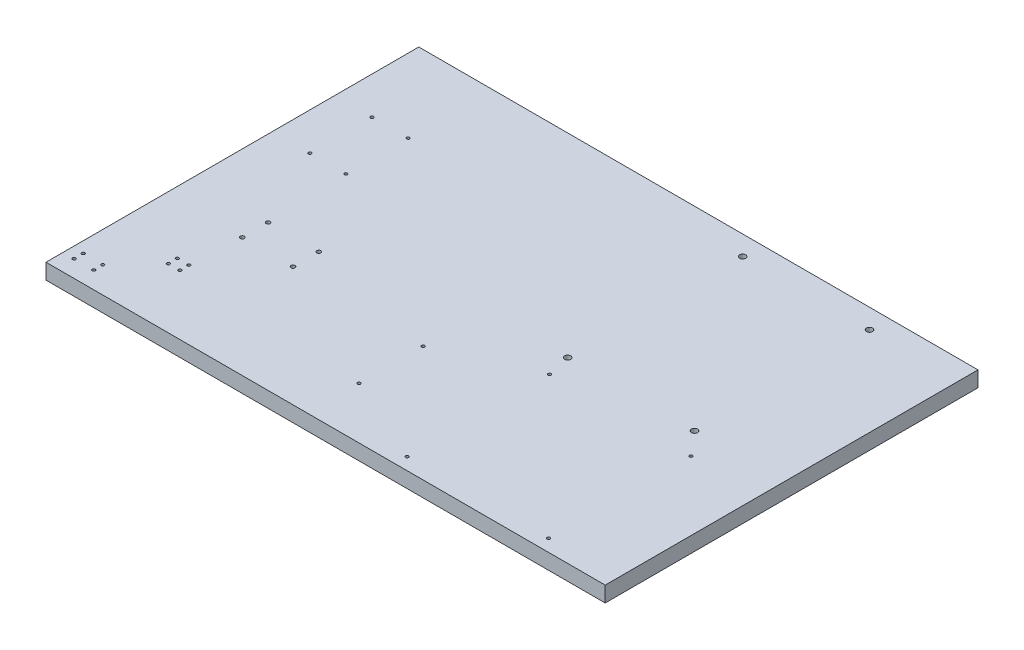
ISO-10303-21;
HEADER;
FILE_DESCRIPTION(('STEP AP214'),'2;1');
FILE_NAME('part.step','',(''),(''),'','','');
FILE_SCHEMA(('AUTOMOTIVE_DESIGN { 1 0 10303 214 1 1 1 1 }'));
ENDSEC;
DATA;
#1=APPLICATION_CONTEXT('core data for automotive mechanical design processes');
#2=APPLICATION_PROTOCOL_DEFINITION('international standard','automotive_design',2000,#1);
#3=PRODUCT_CONTEXT('',#1,'mechanical');
#4=PRODUCT('Part','Part','',(#3));
#5=PRODUCT_RELATED_PRODUCT_CATEGORY('part','',(#4));
#6=PRODUCT_DEFINITION_FORMATION('','',#4);
#7=PRODUCT_DEFINITION_CONTEXT('part definition',#1,'design');
#8=PRODUCT_DEFINITION('design','',#6,#7);
#9=PRODUCT_DEFINITION_SHAPE('','',#8);
#10=(LENGTH_UNIT() NAMED_UNIT(*) SI_UNIT(.MILLI.,.METRE.));
#11=(NAMED_UNIT(*) PLANE_ANGLE_UNIT() SI_UNIT($,.RADIAN.));
#12=(NAMED_UNIT(*) SI_UNIT($,.STERADIAN.) SOLID_ANGLE_UNIT());
#13=UNCERTAINTY_MEASURE_WITH_UNIT(LENGTH_MEASURE(1.E-05),#10,'distance_accuracy_value','');
#14=(GEOMETRIC_REPRESENTATION_CONTEXT(3) GLOBAL_UNCERTAINTY_ASSIGNED_CONTEXT((#13)) GLOBAL_UNIT_ASSIGNED_CONTEXT((#10,
#11,#12)) REPRESENTATION_CONTEXT('',''));
#15=CARTESIAN_POINT('',(0.,0.,0.));
#16=DIRECTION('',(0.,0.,1.));
#17=DIRECTION('',(1.,0.,0.));
#18=AXIS2_PLACEMENT_3D('',#15,#16,#17);
#19=CARTESIAN_POINT('',(0.,12.7,0.));
#20=DIRECTION('',(1.,0.,0.));
#21=DIRECTION('',(0.,0.,-1.));
#22=AXIS2_PLACEMENT_3D('',#19,#20,#21);
#23=PLANE('',#22);
#24=DIRECTION('',(0.,0.,1.));
#25=VECTOR('',#24,1.);
#26=CARTESIAN_POINT('',(0.,0.,0.));
#27=LINE('',#26,#25);
#28=CARTESIAN_POINT('',(0.,0.,-304.8));
#29=VERTEX_POINT('',#28);
#30=CARTESIAN_POINT('',(0.,0.,0.));
#31=VERTEX_POINT('',#30);
#32=EDGE_CURVE('E100',#29,#31,#27,.T.);
#33=ORIENTED_EDGE('',*,*,#32,.T.);
#34=DIRECTION('',(0.,-1.,0.));
#35=VECTOR('',#34,1.);
#36=CARTESIAN_POINT('',(0.,12.7,0.));
#37=LINE('',#36,#35);
#38=CARTESIAN_POINT('',(0.,12.7,0.));
#39=VERTEX_POINT('',#38);
#40=EDGE_CURVE('E11',#39,#31,#37,.T.);
#41=ORIENTED_EDGE('',*,*,#40,.F.);
#42=DIRECTION('',(0.,0.,1.));
#43=VECTOR('',#42,1.);
#44=CARTESIAN_POINT('',(0.,12.7,0.));
#45=LINE('',#44,#43);
#46=CARTESIAN_POINT('',(0.,12.7,-304.8));
#47=VERTEX_POINT('',#46);
#48=EDGE_CURVE('E88',#47,#39,#45,.T.);
#49=ORIENTED_EDGE('',*,*,#48,.F.);
#50=DIRECTION('',(0.,-1.,0.));
#51=VECTOR('',#50,1.);
#52=CARTESIAN_POINT('',(0.,12.7,-304.8));
#53=LINE('',#52,#51);
#54=EDGE_CURVE('E96',#47,#29,#53,.T.);
#55=ORIENTED_EDGE('',*,*,#54,.T.);
#56=EDGE_LOOP('',(#33,#41,#49,#55));
#57=FACE_BOUND('',#56,.T.);
#58=ADVANCED_FACE('F37',(#57),#23,.F.);
#59=CARTESIAN_POINT('',(0.,12.7,0.));
#60=DIRECTION('',(0.,0.,-1.));
#61=DIRECTION('',(-1.,0.,0.));
#62=AXIS2_PLACEMENT_3D('',#59,#60,#61);
#63=PLANE('',#62);
#64=DIRECTION('',(1.,0.,0.));
#65=VECTOR('',#64,1.);
#66=CARTESIAN_POINT('',(0.,0.,0.));
#67=LINE('',#66,#65);
#68=CARTESIAN_POINT('',(457.2,0.,0.));
#69=VERTEX_POINT('',#68);
#70=EDGE_CURVE('E92',#31,#69,#67,.T.);
#71=ORIENTED_EDGE('',*,*,#70,.T.);
#72=DIRECTION('',(0.,-1.,0.));
#73=VECTOR('',#72,1.);
#74=CARTESIAN_POINT('',(457.2,12.7,0.));
#75=LINE('',#74,#73);
#76=CARTESIAN_POINT('',(457.2,12.7,0.));
#77=VERTEX_POINT('',#76);
#78=EDGE_CURVE('E45',#77,#69,#75,.T.);
#79=ORIENTED_EDGE('',*,*,#78,.F.);
#80=DIRECTION('',(1.,0.,0.));
#81=VECTOR('',#80,1.);
#82=CARTESIAN_POINT('',(0.,12.7,0.));
#83=LINE('',#82,#81);
#84=EDGE_CURVE('E83',#39,#77,#83,.T.);
#85=ORIENTED_EDGE('',*,*,#84,.F.);
#86=ORIENTED_EDGE('',*,*,#40,.T.);
#87=EDGE_LOOP('',(#71,#79,#85,#86));
#88=FACE_BOUND('',#87,.T.);
#89=ADVANCED_FACE('F91',(#88),#63,.F.);
#90=CARTESIAN_POINT('',(457.2,12.7,0.));
#91=DIRECTION('',(-1.,0.,0.));
#92=DIRECTION('',(0.,0.,1.));
#93=AXIS2_PLACEMENT_3D('',#90,#91,#92);
#94=PLANE('',#93);
#95=DIRECTION('',(0.,0.,-1.));
#96=VECTOR('',#95,1.);
#97=CARTESIAN_POINT('',(457.2,0.,0.));
#98=LINE('',#97,#96);
#99=CARTESIAN_POINT('',(457.2,0.,-304.8));
#100=VERTEX_POINT('',#99);
#101=EDGE_CURVE('E70',#69,#100,#98,.T.);
#102=ORIENTED_EDGE('',*,*,#101,.T.);
#103=DIRECTION('',(0.,-1.,0.));
#104=VECTOR('',#103,1.);
#105=CARTESIAN_POINT('',(457.2,12.7,-304.8));
#106=LINE('',#105,#104);
#107=CARTESIAN_POINT('',(457.2,12.7,-304.8));
#108=VERTEX_POINT('',#107);
#109=EDGE_CURVE('E93',#108,#100,#106,.T.);
#110=ORIENTED_EDGE('',*,*,#109,.F.);
#111=DIRECTION('',(0.,0.,-1.));
#112=VECTOR('',#111,1.);
#113=CARTESIAN_POINT('',(457.2,12.7,0.));
#114=LINE('',#113,#112);
#115=EDGE_CURVE('E86',#77,#108,#114,.T.);
#116=ORIENTED_EDGE('',*,*,#115,.F.);
#117=ORIENTED_EDGE('',*,*,#78,.T.);
#118=EDGE_LOOP('',(#102,#110,#116,#117));
#119=FACE_BOUND('',#118,.T.);
#120=ADVANCED_FACE('F94',(#119),#94,.F.);
#121=CARTESIAN_POINT('',(0.,12.7,-304.8));
#122=DIRECTION('',(0.,0.,1.));
#123=DIRECTION('',(1.,0.,0.));
#124=AXIS2_PLACEMENT_3D('',#121,#122,#123);
#125=PLANE('',#124);
#126=DIRECTION('',(-1.,0.,0.));
#127=VECTOR('',#126,1.);
#128=CARTESIAN_POINT('',(0.,0.,-304.8));
#129=LINE('',#128,#127);
#130=EDGE_CURVE('E76',#100,#29,#129,.T.);
#131=ORIENTED_EDGE('',*,*,#130,.T.);
#132=ORIENTED_EDGE('',*,*,#54,.F.);
#133=DIRECTION('',(-1.,0.,0.));
#134=VECTOR('',#133,1.);
#135=CARTESIAN_POINT('',(0.,12.7,-304.8));
#136=LINE('',#135,#134);
#137=EDGE_CURVE('E53',#108,#47,#136,.T.);
#138=ORIENTED_EDGE('',*,*,#137,.F.);
#139=ORIENTED_EDGE('',*,*,#109,.T.);
#140=EDGE_LOOP('',(#131,#132,#138,#139));
#141=FACE_BOUND('',#140,.T.);
#142=ADVANCED_FACE('F108',(#141),#125,.F.);
#143=CARTESIAN_POINT('',(0.,12.7,0.));
#144=DIRECTION('',(0.,-1.,0.));
#145=DIRECTION('',(0.,0.,-1.));
#146=AXIS2_PLACEMENT_3D('',#143,#144,#145);
#147=PLANE('',#146);
#148=CARTESIAN_POINT('',(400.9,12.7,-10.));
#149=DIRECTION('',(0.,1.,0.));
#150=DIRECTION('',(0.,0.,1.));
#151=AXIS2_PLACEMENT_3D('',#148,#149,#150);
#152=CIRCLE('',#151,1.24999999999997);
#153=CARTESIAN_POINT('',(400.9,12.7,-8.75000000000003));
#154=VERTEX_POINT('',#153);
#155=EDGE_CURVE('E266',#154,#154,#152,.T.);
#156=ORIENTED_EDGE('',*,*,#155,.F.);
#157=EDGE_LOOP('',(#156));
#158=FACE_BOUND('',#157,.T.);
#159=CARTESIAN_POINT('',(285.3,12.7,-10.));
#160=DIRECTION('',(0.,1.,0.));
#161=DIRECTION('',(0.,0.,1.));
#162=AXIS2_PLACEMENT_3D('',#159,#160,#161);
#163=CIRCLE('',#162,1.24999999999997);
#164=CARTESIAN_POINT('',(285.3,12.7,-8.75000000000003));
#165=VERTEX_POINT('',#164);
#166=EDGE_CURVE('E260',#165,#165,#163,.T.);
#167=ORIENTED_EDGE('',*,*,#166,.F.);
#168=EDGE_LOOP('',(#167));
#169=FACE_BOUND('',#168,.T.);
#170=CARTESIAN_POINT('',(285.3,12.7,-126.425));
#171=DIRECTION('',(0.,1.,0.));
#172=DIRECTION('',(0.,0.,1.));
#173=AXIS2_PLACEMENT_3D('',#170,#171,#172);
#174=CIRCLE('',#173,1.24999999999997);
#175=CARTESIAN_POINT('',(285.3,12.7,-125.175));
#176=VERTEX_POINT('',#175);
#177=EDGE_CURVE('E254',#176,#176,#174,.T.);
#178=ORIENTED_EDGE('',*,*,#177,.F.);
#179=EDGE_LOOP('',(#178));
#180=FACE_BOUND('',#179,.T.);
#181=CARTESIAN_POINT('',(400.9,12.7,-126.425));
#182=DIRECTION('',(0.,1.,0.));
#183=DIRECTION('',(0.,0.,1.));
#184=AXIS2_PLACEMENT_3D('',#181,#182,#183);
#185=CIRCLE('',#184,1.24999999999997);
#186=CARTESIAN_POINT('',(400.9,12.7,-125.175));
#187=VERTEX_POINT('',#186);
#188=EDGE_CURVE('E248',#187,#187,#185,.T.);
#189=ORIENTED_EDGE('',*,*,#188,.F.);
#190=EDGE_LOOP('',(#189));
#191=FACE_BOUND('',#190,.T.);
#192=CARTESIAN_POINT('',(213.72,12.7,-94.6500000000001));
#193=DIRECTION('',(0.,1.,0.));
#194=DIRECTION('',(0.,0.,1.));
#195=AXIS2_PLACEMENT_3D('',#192,#193,#194);
#196=CIRCLE('',#195,1.25);
#197=CARTESIAN_POINT('',(213.72,12.7,-93.4000000000001));
#198=VERTEX_POINT('',#197);
#199=EDGE_CURVE('E242',#198,#198,#196,.T.);
#200=ORIENTED_EDGE('',*,*,#199,.F.);
#201=EDGE_LOOP('',(#200));
#202=FACE_BOUND('',#201,.T.);
#203=CARTESIAN_POINT('',(213.72,12.7,-42.1500000000001));
#204=DIRECTION('',(0.,1.,0.));
#205=DIRECTION('',(0.,0.,1.));
#206=AXIS2_PLACEMENT_3D('',#203,#204,#205);
#207=CIRCLE('',#206,1.25);
#208=CARTESIAN_POINT('',(213.72,12.7,-40.9000000000001));
#209=VERTEX_POINT('',#208);
#210=EDGE_CURVE('E236',#209,#209,#207,.T.);
#211=ORIENTED_EDGE('',*,*,#210,.F.);
#212=EDGE_LOOP('',(#211));
#213=FACE_BOUND('',#212,.T.);
#214=CARTESIAN_POINT('',(384.5,12.7,-288.8));
#215=DIRECTION('',(0.,1.,0.));
#216=DIRECTION('',(0.,0.,1.));
#217=AXIS2_PLACEMENT_3D('',#214,#215,#216);
#218=CIRCLE('',#217,2.5);
#219=CARTESIAN_POINT('',(384.5,12.7,-286.3));
#220=VERTEX_POINT('',#219);
#221=EDGE_CURVE('E230',#220,#220,#218,.T.);
#222=ORIENTED_EDGE('',*,*,#221,.F.);
#223=EDGE_LOOP('',(#222));
#224=FACE_BOUND('',#223,.T.);
#225=CARTESIAN_POINT('',(280.778201797394,12.7,-288.8));
#226=DIRECTION('',(0.,1.,0.));
#227=DIRECTION('',(0.,0.,1.));
#228=AXIS2_PLACEMENT_3D('',#225,#226,#227);
#229=CIRCLE('',#228,2.5);
#230=CARTESIAN_POINT('',(280.778201797394,12.7,-286.3));
#231=VERTEX_POINT('',#230);
#232=EDGE_CURVE('E224',#231,#231,#229,.T.);
#233=ORIENTED_EDGE('',*,*,#232,.F.);
#234=EDGE_LOOP('',(#233));
#235=FACE_BOUND('',#234,.T.);
#236=CARTESIAN_POINT('',(280.778201797394,12.7,-145.71));
#237=DIRECTION('',(0.,1.,0.));
#238=DIRECTION('',(0.,0.,1.));
#239=AXIS2_PLACEMENT_3D('',#236,#237,#238);
#240=CIRCLE('',#239,2.5);
#241=CARTESIAN_POINT('',(280.778201797394,12.7,-143.21));
#242=VERTEX_POINT('',#241);
#243=EDGE_CURVE('E218',#242,#242,#240,.T.);
#244=ORIENTED_EDGE('',*,*,#243,.F.);
#245=EDGE_LOOP('',(#244));
#246=FACE_BOUND('',#245,.T.);
#247=CARTESIAN_POINT('',(384.5,12.7,-145.71));
#248=DIRECTION('',(0.,1.,0.));
#249=DIRECTION('',(0.,0.,1.));
#250=AXIS2_PLACEMENT_3D('',#247,#248,#249);
#251=CIRCLE('',#250,2.5);
#252=CARTESIAN_POINT('',(384.5,12.7,-143.21));
#253=VERTEX_POINT('',#252);
#254=EDGE_CURVE('E212',#253,#253,#251,.T.);
#255=ORIENTED_EDGE('',*,*,#254,.F.);
#256=EDGE_LOOP('',(#255));
#257=FACE_BOUND('',#256,.T.);
#258=CARTESIAN_POINT('',(62.6500000000003,12.7,-97.8492613140313));
#259=DIRECTION('',(0.,1.,0.));
#260=DIRECTION('',(0.,0.,1.));
#261=AXIS2_PLACEMENT_3D('',#258,#259,#260);
#262=CIRCLE('',#261,1.65);
#263=CARTESIAN_POINT('',(62.6500000000003,12.7,-96.1992613140313));
#264=VERTEX_POINT('',#263);
#265=EDGE_CURVE('E206',#264,#264,#262,.T.);
#266=ORIENTED_EDGE('',*,*,#265,.F.);
#267=EDGE_LOOP('',(#266));
#268=FACE_BOUND('',#267,.T.);
#269=CARTESIAN_POINT('',(62.6500000000003,12.7,-118.949261314031));
#270=DIRECTION('',(0.,1.,0.));
#271=DIRECTION('',(0.,0.,1.));
#272=AXIS2_PLACEMENT_3D('',#269,#270,#271);
#273=CIRCLE('',#272,1.65);
#274=CARTESIAN_POINT('',(62.6500000000003,12.7,-117.299261314031));
#275=VERTEX_POINT('',#274);
#276=EDGE_CURVE('E200',#275,#275,#273,.T.);
#277=ORIENTED_EDGE('',*,*,#276,.F.);
#278=EDGE_LOOP('',(#277));
#279=FACE_BOUND('',#278,.T.);
#280=CARTESIAN_POINT('',(104.15,12.7,-118.949261314031));
#281=DIRECTION('',(0.,1.,0.));
#282=DIRECTION('',(0.,0.,1.));
#283=AXIS2_PLACEMENT_3D('',#280,#281,#282);
#284=CIRCLE('',#283,1.65);
#285=CARTESIAN_POINT('',(104.15,12.7,-117.299261314031));
#286=VERTEX_POINT('',#285);
#287=EDGE_CURVE('E194',#286,#286,#284,.T.);
#288=ORIENTED_EDGE('',*,*,#287,.F.);
#289=EDGE_LOOP('',(#288));
#290=FACE_BOUND('',#289,.T.);
#291=CARTESIAN_POINT('',(104.15,12.7,-97.8492613140314));
#292=DIRECTION('',(0.,1.,0.));
#293=DIRECTION('',(0.,0.,1.));
#294=AXIS2_PLACEMENT_3D('',#291,#292,#293);
#295=CIRCLE('',#294,1.65);
#296=CARTESIAN_POINT('',(104.15,12.7,-96.1992613140314));
#297=VERTEX_POINT('',#296);
#298=EDGE_CURVE('E188',#297,#297,#295,.T.);
#299=ORIENTED_EDGE('',*,*,#298,.F.);
#300=EDGE_LOOP('',(#299));
#301=FACE_BOUND('',#300,.T.);
#302=CARTESIAN_POINT('',(60.1249844000001,12.7,-235.924));
#303=DIRECTION('',(0.,1.,0.));
#304=DIRECTION('',(0.,0.,1.));
#305=AXIS2_PLACEMENT_3D('',#302,#303,#304);
#306=CIRCLE('',#305,1.25);
#307=CARTESIAN_POINT('',(60.1249844000001,12.7,-234.674));
#308=VERTEX_POINT('',#307);
#309=EDGE_CURVE('E182',#308,#308,#306,.T.);
#310=ORIENTED_EDGE('',*,*,#309,.F.);
#311=EDGE_LOOP('',(#310));
#312=FACE_BOUND('',#311,.T.);
#313=CARTESIAN_POINT('',(60.1249844,12.7,-185.124));
#314=DIRECTION('',(0.,1.,0.));
#315=DIRECTION('',(0.,0.,1.));
#316=AXIS2_PLACEMENT_3D('',#313,#314,#315);
#317=CIRCLE('',#316,1.25);
#318=CARTESIAN_POINT('',(60.1249844,12.7,-183.874));
#319=VERTEX_POINT('',#318);
#320=EDGE_CURVE('E176',#319,#319,#317,.T.);
#321=ORIENTED_EDGE('',*,*,#320,.F.);
#322=EDGE_LOOP('',(#321));
#323=FACE_BOUND('',#322,.T.);
#324=CARTESIAN_POINT('',(30.6249948,12.7,-185.124));
#325=DIRECTION('',(0.,1.,0.));
#326=DIRECTION('',(0.,0.,1.));
#327=AXIS2_PLACEMENT_3D('',#324,#325,#326);
#328=CIRCLE('',#327,1.25);
#329=CARTESIAN_POINT('',(30.6249948,12.7,-183.874));
#330=VERTEX_POINT('',#329);
#331=EDGE_CURVE('E170',#330,#330,#328,.T.);
#332=ORIENTED_EDGE('',*,*,#331,.F.);
#333=EDGE_LOOP('',(#332));
#334=FACE_BOUND('',#333,.T.);
#335=CARTESIAN_POINT('',(30.6249948000001,12.7,-235.924));
#336=DIRECTION('',(0.,1.,0.));
#337=DIRECTION('',(0.,0.,1.));
#338=AXIS2_PLACEMENT_3D('',#335,#336,#337);
#339=CIRCLE('',#338,1.25);
#340=CARTESIAN_POINT('',(30.6249948000001,12.7,-234.674));
#341=VERTEX_POINT('',#340);
#342=EDGE_CURVE('E164',#341,#341,#339,.T.);
#343=ORIENTED_EDGE('',*,*,#342,.F.);
#344=EDGE_LOOP('',(#343));
#345=FACE_BOUND('',#344,.T.);
#346=CARTESIAN_POINT('',(9.00000000000001,12.7,-21.4));
#347=DIRECTION('',(0.,1.,0.));
#348=DIRECTION('',(0.,0.,1.));
#349=AXIS2_PLACEMENT_3D('',#346,#347,#348);
#350=CIRCLE('',#349,1.24999999999999);
#351=CARTESIAN_POINT('',(9.00000000000001,12.7,-20.15));
#352=VERTEX_POINT('',#351);
#353=EDGE_CURVE('E158',#352,#352,#350,.T.);
#354=ORIENTED_EDGE('',*,*,#353,.F.);
#355=EDGE_LOOP('',(#354));
#356=FACE_BOUND('',#355,.T.);
#357=CARTESIAN_POINT('',(25.,12.7,-21.3999999999994));
#358=DIRECTION('',(0.,1.,0.));
#359=DIRECTION('',(0.,0.,1.));
#360=AXIS2_PLACEMENT_3D('',#357,#358,#359);
#361=CIRCLE('',#360,1.24999999999999);
#362=CARTESIAN_POINT('',(25.,12.7,-20.1499999999994));
#363=VERTEX_POINT('',#362);
#364=EDGE_CURVE('E152',#363,#363,#361,.T.);
#365=ORIENTED_EDGE('',*,*,#364,.F.);
#366=EDGE_LOOP('',(#365));
#367=FACE_BOUND('',#366,.T.);
#368=CARTESIAN_POINT('',(25.,12.7,-13.9999999999994));
#369=DIRECTION('',(0.,1.,0.));
#370=DIRECTION('',(0.,0.,1.));
#371=AXIS2_PLACEMENT_3D('',#368,#369,#370);
#372=CIRCLE('',#371,1.24999999999999);
#373=CARTESIAN_POINT('',(25.,12.7,-12.7499999999994));
#374=VERTEX_POINT('',#373);
#375=EDGE_CURVE('E146',#374,#374,#372,.T.);
#376=ORIENTED_EDGE('',*,*,#375,.F.);
#377=EDGE_LOOP('',(#376));
#378=FACE_BOUND('',#377,.T.);
#379=CARTESIAN_POINT('',(9.00000000000001,12.7,-13.9999999999994));
#380=DIRECTION('',(0.,1.,0.));
#381=DIRECTION('',(0.,0.,1.));
#382=AXIS2_PLACEMENT_3D('',#379,#380,#381);
#383=CIRCLE('',#382,1.24999999999999);
#384=CARTESIAN_POINT('',(9.00000000000001,12.7,-12.7499999999994));
#385=VERTEX_POINT('',#384);
#386=EDGE_CURVE('E140',#385,#385,#383,.T.);
#387=ORIENTED_EDGE('',*,*,#386,.F.);
#388=EDGE_LOOP('',(#387));
#389=FACE_BOUND('',#388,.T.);
#390=CARTESIAN_POINT('',(50.9999999999982,12.7,-56.3999999999996));
#391=DIRECTION('',(0.,1.,0.));
#392=DIRECTION('',(0.,0.,1.));
#393=AXIS2_PLACEMENT_3D('',#390,#391,#392);
#394=CIRCLE('',#393,1.24999999999999);
#395=CARTESIAN_POINT('',(50.9999999999982,12.7,-55.1499999999996));
#396=VERTEX_POINT('',#395);
#397=EDGE_CURVE('E134',#396,#396,#394,.T.);
#398=ORIENTED_EDGE('',*,*,#397,.F.);
#399=EDGE_LOOP('',(#398));
#400=FACE_BOUND('',#399,.T.);
#401=CARTESIAN_POINT('',(60.3999999999982,12.7,-56.3999999999995));
#402=DIRECTION('',(0.,1.,0.));
#403=DIRECTION('',(0.,0.,1.));
#404=AXIS2_PLACEMENT_3D('',#401,#402,#403);
#405=CIRCLE('',#404,1.24999999999999);
#406=CARTESIAN_POINT('',(60.3999999999982,12.7,-55.1499999999995));
#407=VERTEX_POINT('',#406);
#408=EDGE_CURVE('E128',#407,#407,#405,.T.);
#409=ORIENTED_EDGE('',*,*,#408,.F.);
#410=EDGE_LOOP('',(#409));
#411=FACE_BOUND('',#410,.T.);
#412=CARTESIAN_POINT('',(60.3999999999981,12.7,-48.9999999999995));
#413=DIRECTION('',(0.,1.,0.));
#414=DIRECTION('',(0.,0.,1.));
#415=AXIS2_PLACEMENT_3D('',#412,#413,#414);
#416=CIRCLE('',#415,1.24999999999999);
#417=CARTESIAN_POINT('',(60.3999999999981,12.7,-47.7499999999995));
#418=VERTEX_POINT('',#417);
#419=EDGE_CURVE('E122',#418,#418,#416,.T.);
#420=ORIENTED_EDGE('',*,*,#419,.F.);
#421=EDGE_LOOP('',(#420));
#422=FACE_BOUND('',#421,.T.);
#423=CARTESIAN_POINT('',(50.9999999999981,12.7,-48.9999999999996));
#424=DIRECTION('',(0.,1.,0.));
#425=DIRECTION('',(0.,0.,1.));
#426=AXIS2_PLACEMENT_3D('',#423,#424,#425);
#427=CIRCLE('',#426,1.24999999999999);
#428=CARTESIAN_POINT('',(50.9999999999981,12.7,-47.7499999999996));
#429=VERTEX_POINT('',#428);
#430=EDGE_CURVE('E116',#429,#429,#427,.T.);
#431=ORIENTED_EDGE('',*,*,#430,.F.);
#432=EDGE_LOOP('',(#431));
#433=FACE_BOUND('',#432,.T.);
#434=ORIENTED_EDGE('',*,*,#48,.T.);
#435=ORIENTED_EDGE('',*,*,#84,.T.);
#436=ORIENTED_EDGE('',*,*,#115,.T.);
#437=ORIENTED_EDGE('',*,*,#137,.T.);
#438=EDGE_LOOP('',(#434,#435,#436,#437));
#439=FACE_BOUND('',#438,.T.);
#440=ADVANCED_FACE('F84',(#158,#169,#180,#191,#202,#213,#224,#235,#246,#257,#268,#279,#290,#301,
#312,#323,#334,#345,#356,#367,#378,#389,#400,#411,#422,#433,#439),#147,.F.);
#441=CARTESIAN_POINT('',(0.,0.,0.));
#442=DIRECTION('',(0.,-1.,0.));
#443=DIRECTION('',(0.,0.,-1.));
#444=AXIS2_PLACEMENT_3D('',#441,#442,#443);
#445=PLANE('',#444);
#446=CARTESIAN_POINT('',(400.9,0.,-10.));
#447=DIRECTION('',(0.,1.,0.));
#448=DIRECTION('',(0.,0.,1.));
#449=AXIS2_PLACEMENT_3D('',#446,#447,#448);
#450=CIRCLE('',#449,1.24999999999997);
#451=CARTESIAN_POINT('',(400.9,0.,-8.75000000000003));
#452=VERTEX_POINT('',#451);
#453=EDGE_CURVE('E263',#452,#452,#450,.T.);
#454=ORIENTED_EDGE('',*,*,#453,.T.);
#455=EDGE_LOOP('',(#454));
#456=FACE_BOUND('',#455,.T.);
#457=CARTESIAN_POINT('',(285.3,0.,-10.));
#458=DIRECTION('',(0.,1.,0.));
#459=DIRECTION('',(0.,0.,1.));
#460=AXIS2_PLACEMENT_3D('',#457,#458,#459);
#461=CIRCLE('',#460,1.24999999999997);
#462=CARTESIAN_POINT('',(285.3,0.,-8.75000000000003));
#463=VERTEX_POINT('',#462);
#464=EDGE_CURVE('E257',#463,#463,#461,.T.);
#465=ORIENTED_EDGE('',*,*,#464,.T.);
#466=EDGE_LOOP('',(#465));
#467=FACE_BOUND('',#466,.T.);
#468=CARTESIAN_POINT('',(285.3,0.,-126.425));
#469=DIRECTION('',(0.,1.,0.));
#470=DIRECTION('',(0.,0.,1.));
#471=AXIS2_PLACEMENT_3D('',#468,#469,#470);
#472=CIRCLE('',#471,1.24999999999997);
#473=CARTESIAN_POINT('',(285.3,0.,-125.175));
#474=VERTEX_POINT('',#473);
#475=EDGE_CURVE('E251',#474,#474,#472,.T.);
#476=ORIENTED_EDGE('',*,*,#475,.T.);
#477=EDGE_LOOP('',(#476));
#478=FACE_BOUND('',#477,.T.);
#479=CARTESIAN_POINT('',(400.9,0.,-126.425));
#480=DIRECTION('',(0.,1.,0.));
#481=DIRECTION('',(0.,0.,1.));
#482=AXIS2_PLACEMENT_3D('',#479,#480,#481);
#483=CIRCLE('',#482,1.24999999999997);
#484=CARTESIAN_POINT('',(400.9,0.,-125.175));
#485=VERTEX_POINT('',#484);
#486=EDGE_CURVE('E245',#485,#485,#483,.T.);
#487=ORIENTED_EDGE('',*,*,#486,.T.);
#488=EDGE_LOOP('',(#487));
#489=FACE_BOUND('',#488,.T.);
#490=CARTESIAN_POINT('',(213.72,0.,-94.6500000000001));
#491=DIRECTION('',(0.,1.,0.));
#492=DIRECTION('',(0.,0.,1.));
#493=AXIS2_PLACEMENT_3D('',#490,#491,#492);
#494=CIRCLE('',#493,1.25);
#495=CARTESIAN_POINT('',(213.72,0.,-93.4000000000001));
#496=VERTEX_POINT('',#495);
#497=EDGE_CURVE('E239',#496,#496,#494,.T.);
#498=ORIENTED_EDGE('',*,*,#497,.T.);
#499=EDGE_LOOP('',(#498));
#500=FACE_BOUND('',#499,.T.);
#501=CARTESIAN_POINT('',(213.72,0.,-42.1500000000001));
#502=DIRECTION('',(0.,1.,0.));
#503=DIRECTION('',(0.,0.,1.));
#504=AXIS2_PLACEMENT_3D('',#501,#502,#503);
#505=CIRCLE('',#504,1.25);
#506=CARTESIAN_POINT('',(213.72,0.,-40.9000000000001));
#507=VERTEX_POINT('',#506);
#508=EDGE_CURVE('E233',#507,#507,#505,.T.);
#509=ORIENTED_EDGE('',*,*,#508,.T.);
#510=EDGE_LOOP('',(#509));
#511=FACE_BOUND('',#510,.T.);
#512=CARTESIAN_POINT('',(384.5,0.,-288.8));
#513=DIRECTION('',(0.,1.,0.));
#514=DIRECTION('',(0.,0.,1.));
#515=AXIS2_PLACEMENT_3D('',#512,#513,#514);
#516=CIRCLE('',#515,2.5);
#517=CARTESIAN_POINT('',(384.5,0.,-286.3));
#518=VERTEX_POINT('',#517);
#519=EDGE_CURVE('E227',#518,#518,#516,.T.);
#520=ORIENTED_EDGE('',*,*,#519,.T.);
#521=EDGE_LOOP('',(#520));
#522=FACE_BOUND('',#521,.T.);
#523=CARTESIAN_POINT('',(280.778201797394,0.,-288.8));
#524=DIRECTION('',(0.,1.,0.));
#525=DIRECTION('',(0.,0.,1.));
#526=AXIS2_PLACEMENT_3D('',#523,#524,#525);
#527=CIRCLE('',#526,2.5);
#528=CARTESIAN_POINT('',(280.778201797394,0.,-286.3));
#529=VERTEX_POINT('',#528);
#530=EDGE_CURVE('E221',#529,#529,#527,.T.);
#531=ORIENTED_EDGE('',*,*,#530,.T.);
#532=EDGE_LOOP('',(#531));
#533=FACE_BOUND('',#532,.T.);
#534=CARTESIAN_POINT('',(280.778201797394,0.,-145.71));
#535=DIRECTION('',(0.,1.,0.));
#536=DIRECTION('',(0.,0.,1.));
#537=AXIS2_PLACEMENT_3D('',#534,#535,#536);
#538=CIRCLE('',#537,2.5);
#539=CARTESIAN_POINT('',(280.778201797394,0.,-143.21));
#540=VERTEX_POINT('',#539);
#541=EDGE_CURVE('E215',#540,#540,#538,.T.);
#542=ORIENTED_EDGE('',*,*,#541,.T.);
#543=EDGE_LOOP('',(#542));
#544=FACE_BOUND('',#543,.T.);
#545=CARTESIAN_POINT('',(384.5,0.,-145.71));
#546=DIRECTION('',(0.,1.,0.));
#547=DIRECTION('',(0.,0.,1.));
#548=AXIS2_PLACEMENT_3D('',#545,#546,#547);
#549=CIRCLE('',#548,2.5);
#550=CARTESIAN_POINT('',(384.5,0.,-143.21));
#551=VERTEX_POINT('',#550);
#552=EDGE_CURVE('E209',#551,#551,#549,.T.);
#553=ORIENTED_EDGE('',*,*,#552,.T.);
#554=EDGE_LOOP('',(#553));
#555=FACE_BOUND('',#554,.T.);
#556=CARTESIAN_POINT('',(62.6500000000003,0.,-97.8492613140313));
#557=DIRECTION('',(0.,1.,0.));
#558=DIRECTION('',(0.,0.,1.));
#559=AXIS2_PLACEMENT_3D('',#556,#557,#558);
#560=CIRCLE('',#559,1.65);
#561=CARTESIAN_POINT('',(62.6500000000003,0.,-96.1992613140313));
#562=VERTEX_POINT('',#561);
#563=EDGE_CURVE('E203',#562,#562,#560,.T.);
#564=ORIENTED_EDGE('',*,*,#563,.T.);
#565=EDGE_LOOP('',(#564));
#566=FACE_BOUND('',#565,.T.);
#567=CARTESIAN_POINT('',(62.6500000000003,0.,-118.949261314031));
#568=DIRECTION('',(0.,1.,0.));
#569=DIRECTION('',(0.,0.,1.));
#570=AXIS2_PLACEMENT_3D('',#567,#568,#569);
#571=CIRCLE('',#570,1.65);
#572=CARTESIAN_POINT('',(62.6500000000003,0.,-117.299261314031));
#573=VERTEX_POINT('',#572);
#574=EDGE_CURVE('E197',#573,#573,#571,.T.);
#575=ORIENTED_EDGE('',*,*,#574,.T.);
#576=EDGE_LOOP('',(#575));
#577=FACE_BOUND('',#576,.T.);
#578=CARTESIAN_POINT('',(104.15,0.,-118.949261314031));
#579=DIRECTION('',(0.,1.,0.));
#580=DIRECTION('',(0.,0.,1.));
#581=AXIS2_PLACEMENT_3D('',#578,#579,#580);
#582=CIRCLE('',#581,1.65);
#583=CARTESIAN_POINT('',(104.15,0.,-117.299261314031));
#584=VERTEX_POINT('',#583);
#585=EDGE_CURVE('E191',#584,#584,#582,.T.);
#586=ORIENTED_EDGE('',*,*,#585,.T.);
#587=EDGE_LOOP('',(#586));
#588=FACE_BOUND('',#587,.T.);
#589=CARTESIAN_POINT('',(104.15,0.,-97.8492613140314));
#590=DIRECTION('',(0.,1.,0.));
#591=DIRECTION('',(0.,0.,1.));
#592=AXIS2_PLACEMENT_3D('',#589,#590,#591);
#593=CIRCLE('',#592,1.65);
#594=CARTESIAN_POINT('',(104.15,0.,-96.1992613140314));
#595=VERTEX_POINT('',#594);
#596=EDGE_CURVE('E185',#595,#595,#593,.T.);
#597=ORIENTED_EDGE('',*,*,#596,.T.);
#598=EDGE_LOOP('',(#597));
#599=FACE_BOUND('',#598,.T.);
#600=CARTESIAN_POINT('',(60.1249844000001,0.,-235.924));
#601=DIRECTION('',(0.,1.,0.));
#602=DIRECTION('',(0.,0.,1.));
#603=AXIS2_PLACEMENT_3D('',#600,#601,#602);
#604=CIRCLE('',#603,1.24999999999999);
#605=CARTESIAN_POINT('',(60.1249844000001,0.,-234.674));
#606=VERTEX_POINT('',#605);
#607=EDGE_CURVE('E179',#606,#606,#604,.T.);
#608=ORIENTED_EDGE('',*,*,#607,.T.);
#609=EDGE_LOOP('',(#608));
#610=FACE_BOUND('',#609,.T.);
#611=CARTESIAN_POINT('',(60.1249844,0.,-185.124));
#612=DIRECTION('',(0.,1.,0.));
#613=DIRECTION('',(0.,0.,1.));
#614=AXIS2_PLACEMENT_3D('',#611,#612,#613);
#615=CIRCLE('',#614,1.24999999999999);
#616=CARTESIAN_POINT('',(60.1249844,0.,-183.874));
#617=VERTEX_POINT('',#616);
#618=EDGE_CURVE('E173',#617,#617,#615,.T.);
#619=ORIENTED_EDGE('',*,*,#618,.T.);
#620=EDGE_LOOP('',(#619));
#621=FACE_BOUND('',#620,.T.);
#622=CARTESIAN_POINT('',(30.6249948,0.,-185.124));
#623=DIRECTION('',(0.,1.,0.));
#624=DIRECTION('',(0.,0.,1.));
#625=AXIS2_PLACEMENT_3D('',#622,#623,#624);
#626=CIRCLE('',#625,1.24999999999999);
#627=CARTESIAN_POINT('',(30.6249948,0.,-183.874));
#628=VERTEX_POINT('',#627);
#629=EDGE_CURVE('E167',#628,#628,#626,.T.);
#630=ORIENTED_EDGE('',*,*,#629,.T.);
#631=EDGE_LOOP('',(#630));
#632=FACE_BOUND('',#631,.T.);
#633=CARTESIAN_POINT('',(30.6249948000001,0.,-235.924));
#634=DIRECTION('',(0.,1.,0.));
#635=DIRECTION('',(0.,0.,1.));
#636=AXIS2_PLACEMENT_3D('',#633,#634,#635);
#637=CIRCLE('',#636,1.24999999999999);
#638=CARTESIAN_POINT('',(30.6249948000001,0.,-234.674));
#639=VERTEX_POINT('',#638);
#640=EDGE_CURVE('E161',#639,#639,#637,.T.);
#641=ORIENTED_EDGE('',*,*,#640,.T.);
#642=EDGE_LOOP('',(#641));
#643=FACE_BOUND('',#642,.T.);
#644=CARTESIAN_POINT('',(9.00000000000001,0.,-21.4));
#645=DIRECTION('',(0.,1.,0.));
#646=DIRECTION('',(0.,0.,1.));
#647=AXIS2_PLACEMENT_3D('',#644,#645,#646);
#648=CIRCLE('',#647,1.25);
#649=CARTESIAN_POINT('',(9.00000000000001,0.,-20.15));
#650=VERTEX_POINT('',#649);
#651=EDGE_CURVE('E155',#650,#650,#648,.T.);
#652=ORIENTED_EDGE('',*,*,#651,.T.);
#653=EDGE_LOOP('',(#652));
#654=FACE_BOUND('',#653,.T.);
#655=CARTESIAN_POINT('',(25.,0.,-21.3999999999994));
#656=DIRECTION('',(0.,1.,0.));
#657=DIRECTION('',(0.,0.,1.));
#658=AXIS2_PLACEMENT_3D('',#655,#656,#657);
#659=CIRCLE('',#658,1.25);
#660=CARTESIAN_POINT('',(25.,0.,-20.1499999999994));
#661=VERTEX_POINT('',#660);
#662=EDGE_CURVE('E149',#661,#661,#659,.T.);
#663=ORIENTED_EDGE('',*,*,#662,.T.);
#664=EDGE_LOOP('',(#663));
#665=FACE_BOUND('',#664,.T.);
#666=CARTESIAN_POINT('',(25.,0.,-13.9999999999994));
#667=DIRECTION('',(0.,1.,0.));
#668=DIRECTION('',(0.,0.,1.));
#669=AXIS2_PLACEMENT_3D('',#666,#667,#668);
#670=CIRCLE('',#669,1.25);
#671=CARTESIAN_POINT('',(25.,0.,-12.7499999999994));
#672=VERTEX_POINT('',#671);
#673=EDGE_CURVE('E143',#672,#672,#670,.T.);
#674=ORIENTED_EDGE('',*,*,#673,.T.);
#675=EDGE_LOOP('',(#674));
#676=FACE_BOUND('',#675,.T.);
#677=CARTESIAN_POINT('',(9.00000000000001,0.,-13.9999999999994));
#678=DIRECTION('',(0.,1.,0.));
#679=DIRECTION('',(0.,0.,1.));
#680=AXIS2_PLACEMENT_3D('',#677,#678,#679);
#681=CIRCLE('',#680,1.25);
#682=CARTESIAN_POINT('',(9.00000000000001,0.,-12.7499999999994));
#683=VERTEX_POINT('',#682);
#684=EDGE_CURVE('E137',#683,#683,#681,.T.);
#685=ORIENTED_EDGE('',*,*,#684,.T.);
#686=EDGE_LOOP('',(#685));
#687=FACE_BOUND('',#686,.T.);
#688=CARTESIAN_POINT('',(50.9999999999982,0.,-56.3999999999996));
#689=DIRECTION('',(0.,1.,0.));
#690=DIRECTION('',(0.,0.,1.));
#691=AXIS2_PLACEMENT_3D('',#688,#689,#690);
#692=CIRCLE('',#691,1.24999999999999);
#693=CARTESIAN_POINT('',(50.9999999999982,0.,-55.1499999999996));
#694=VERTEX_POINT('',#693);
#695=EDGE_CURVE('E131',#694,#694,#692,.T.);
#696=ORIENTED_EDGE('',*,*,#695,.T.);
#697=EDGE_LOOP('',(#696));
#698=FACE_BOUND('',#697,.T.);
#699=CARTESIAN_POINT('',(60.3999999999982,0.,-56.3999999999995));
#700=DIRECTION('',(0.,1.,0.));
#701=DIRECTION('',(0.,0.,1.));
#702=AXIS2_PLACEMENT_3D('',#699,#700,#701);
#703=CIRCLE('',#702,1.24999999999999);
#704=CARTESIAN_POINT('',(60.3999999999982,0.,-55.1499999999995));
#705=VERTEX_POINT('',#704);
#706=EDGE_CURVE('E125',#705,#705,#703,.T.);
#707=ORIENTED_EDGE('',*,*,#706,.T.);
#708=EDGE_LOOP('',(#707));
#709=FACE_BOUND('',#708,.T.);
#710=CARTESIAN_POINT('',(60.3999999999981,0.,-48.9999999999995));
#711=DIRECTION('',(0.,1.,0.));
#712=DIRECTION('',(0.,0.,1.));
#713=AXIS2_PLACEMENT_3D('',#710,#711,#712);
#714=CIRCLE('',#713,1.25);
#715=CARTESIAN_POINT('',(60.3999999999981,0.,-47.7499999999995));
#716=VERTEX_POINT('',#715);
#717=EDGE_CURVE('E119',#716,#716,#714,.T.);
#718=ORIENTED_EDGE('',*,*,#717,.T.);
#719=EDGE_LOOP('',(#718));
#720=FACE_BOUND('',#719,.T.);
#721=CARTESIAN_POINT('',(50.9999999999981,0.,-48.9999999999996));
#722=DIRECTION('',(0.,1.,0.));
#723=DIRECTION('',(0.,0.,1.));
#724=AXIS2_PLACEMENT_3D('',#721,#722,#723);
#725=CIRCLE('',#724,1.24999999999999);
#726=CARTESIAN_POINT('',(50.9999999999981,0.,-47.7499999999996));
#727=VERTEX_POINT('',#726);
#728=EDGE_CURVE('E103',#727,#727,#725,.T.);
#729=ORIENTED_EDGE('',*,*,#728,.T.);
#730=EDGE_LOOP('',(#729));
#731=FACE_BOUND('',#730,.T.);
#732=ORIENTED_EDGE('',*,*,#32,.F.);
#733=ORIENTED_EDGE('',*,*,#130,.F.);
#734=ORIENTED_EDGE('',*,*,#101,.F.);
#735=ORIENTED_EDGE('',*,*,#70,.F.);
#736=EDGE_LOOP('',(#732,#733,#734,#735));
#737=FACE_BOUND('',#736,.T.);
#738=ADVANCED_FACE('F111',(#456,#467,#478,#489,#500,#511,#522,#533,#544,#555,#566,#577,#588,
#599,#610,#621,#632,#643,#654,#665,#676,#687,#698,#709,#720,#731,#737),#445,.T.);
#739=CARTESIAN_POINT('',(50.9999999999981,12.7,-48.9999999999996));
#740=DIRECTION('',(0.,1.,0.));
#741=DIRECTION('',(0.,0.,1.));
#742=AXIS2_PLACEMENT_3D('',#739,#740,#741);
#743=CYLINDRICAL_SURFACE('',#742,1.24999999999999);
#744=ORIENTED_EDGE('',*,*,#728,.F.);
#745=EDGE_LOOP('',(#744));
#746=FACE_BOUND('',#745,.T.);
#747=ORIENTED_EDGE('',*,*,#430,.T.);
#748=EDGE_LOOP('',(#747));
#749=FACE_BOUND('',#748,.T.);
#750=ADVANCED_FACE('F325',(#746,#749),#743,.F.);
#751=CARTESIAN_POINT('',(60.3999999999981,12.7,-48.9999999999995));
#752=DIRECTION('',(0.,1.,0.));
#753=DIRECTION('',(0.,0.,1.));
#754=AXIS2_PLACEMENT_3D('',#751,#752,#753);
#755=CYLINDRICAL_SURFACE('',#754,1.24999999999999);
#756=ORIENTED_EDGE('',*,*,#717,.F.);
#757=EDGE_LOOP('',(#756));
#758=FACE_BOUND('',#757,.T.);
#759=ORIENTED_EDGE('',*,*,#419,.T.);
#760=EDGE_LOOP('',(#759));
#761=FACE_BOUND('',#760,.T.);
#762=ADVANCED_FACE('F327',(#758,#761),#755,.F.);
#763=CARTESIAN_POINT('',(60.3999999999982,12.7,-56.3999999999995));
#764=DIRECTION('',(0.,1.,0.));
#765=DIRECTION('',(0.,0.,1.));
#766=AXIS2_PLACEMENT_3D('',#763,#764,#765);
#767=CYLINDRICAL_SURFACE('',#766,1.24999999999999);
#768=ORIENTED_EDGE('',*,*,#706,.F.);
#769=EDGE_LOOP('',(#768));
#770=FACE_BOUND('',#769,.T.);
#771=ORIENTED_EDGE('',*,*,#408,.T.);
#772=EDGE_LOOP('',(#771));
#773=FACE_BOUND('',#772,.T.);
#774=ADVANCED_FACE('F334',(#770,#773),#767,.F.);
#775=CARTESIAN_POINT('',(50.9999999999982,12.7,-56.3999999999996));
#776=DIRECTION('',(0.,1.,0.));
#777=DIRECTION('',(0.,0.,1.));
#778=AXIS2_PLACEMENT_3D('',#775,#776,#777);
#779=CYLINDRICAL_SURFACE('',#778,1.24999999999999);
#780=ORIENTED_EDGE('',*,*,#695,.F.);
#781=EDGE_LOOP('',(#780));
#782=FACE_BOUND('',#781,.T.);
#783=ORIENTED_EDGE('',*,*,#397,.T.);
#784=EDGE_LOOP('',(#783));
#785=FACE_BOUND('',#784,.T.);
#786=ADVANCED_FACE('F578',(#782,#785),#779,.F.);
#787=CARTESIAN_POINT('',(9.00000000000001,12.7,-13.9999999999994));
#788=DIRECTION('',(0.,1.,0.));
#789=DIRECTION('',(0.,0.,1.));
#790=AXIS2_PLACEMENT_3D('',#787,#788,#789);
#791=CYLINDRICAL_SURFACE('',#790,1.24999999999999);
#792=ORIENTED_EDGE('',*,*,#684,.F.);
#793=EDGE_LOOP('',(#792));
#794=FACE_BOUND('',#793,.T.);
#795=ORIENTED_EDGE('',*,*,#386,.T.);
#796=EDGE_LOOP('',(#795));
#797=FACE_BOUND('',#796,.T.);
#798=ADVANCED_FACE('F570',(#794,#797),#791,.F.);
#799=CARTESIAN_POINT('',(25.,12.7,-13.9999999999994));
#800=DIRECTION('',(0.,1.,0.));
#801=DIRECTION('',(0.,0.,1.));
#802=AXIS2_PLACEMENT_3D('',#799,#800,#801);
#803=CYLINDRICAL_SURFACE('',#802,1.24999999999999);
#804=ORIENTED_EDGE('',*,*,#673,.F.);
#805=EDGE_LOOP('',(#804));
#806=FACE_BOUND('',#805,.T.);
#807=ORIENTED_EDGE('',*,*,#375,.T.);
#808=EDGE_LOOP('',(#807));
#809=FACE_BOUND('',#808,.T.);
#810=ADVANCED_FACE('F562',(#806,#809),#803,.F.);
#811=CARTESIAN_POINT('',(25.,12.7,-21.3999999999994));
#812=DIRECTION('',(0.,1.,0.));
#813=DIRECTION('',(0.,0.,1.));
#814=AXIS2_PLACEMENT_3D('',#811,#812,#813);
#815=CYLINDRICAL_SURFACE('',#814,1.24999999999999);
#816=ORIENTED_EDGE('',*,*,#662,.F.);
#817=EDGE_LOOP('',(#816));
#818=FACE_BOUND('',#817,.T.);
#819=ORIENTED_EDGE('',*,*,#364,.T.);
#820=EDGE_LOOP('',(#819));
#821=FACE_BOUND('',#820,.T.);
#822=ADVANCED_FACE('F554',(#818,#821),#815,.F.);
#823=CARTESIAN_POINT('',(9.00000000000001,12.7,-21.4));
#824=DIRECTION('',(0.,1.,0.));
#825=DIRECTION('',(0.,0.,1.));
#826=AXIS2_PLACEMENT_3D('',#823,#824,#825);
#827=CYLINDRICAL_SURFACE('',#826,1.24999999999999);
#828=ORIENTED_EDGE('',*,*,#651,.F.);
#829=EDGE_LOOP('',(#828));
#830=FACE_BOUND('',#829,.T.);
#831=ORIENTED_EDGE('',*,*,#353,.T.);
#832=EDGE_LOOP('',(#831));
#833=FACE_BOUND('',#832,.T.);
#834=ADVANCED_FACE('F546',(#830,#833),#827,.F.);
#835=CARTESIAN_POINT('',(30.6249948000001,12.7,-235.924));
#836=DIRECTION('',(0.,1.,0.));
#837=DIRECTION('',(0.,0.,1.));
#838=AXIS2_PLACEMENT_3D('',#835,#836,#837);
#839=CYLINDRICAL_SURFACE('',#838,1.25);
#840=ORIENTED_EDGE('',*,*,#640,.F.);
#841=EDGE_LOOP('',(#840));
#842=FACE_BOUND('',#841,.T.);
#843=ORIENTED_EDGE('',*,*,#342,.T.);
#844=EDGE_LOOP('',(#843));
#845=FACE_BOUND('',#844,.T.);
#846=ADVANCED_FACE('F538',(#842,#845),#839,.F.);
#847=CARTESIAN_POINT('',(30.6249948,12.7,-185.124));
#848=DIRECTION('',(0.,1.,0.));
#849=DIRECTION('',(0.,0.,1.));
#850=AXIS2_PLACEMENT_3D('',#847,#848,#849);
#851=CYLINDRICAL_SURFACE('',#850,1.25);
#852=ORIENTED_EDGE('',*,*,#629,.F.);
#853=EDGE_LOOP('',(#852));
#854=FACE_BOUND('',#853,.T.);
#855=ORIENTED_EDGE('',*,*,#331,.T.);
#856=EDGE_LOOP('',(#855));
#857=FACE_BOUND('',#856,.T.);
#858=ADVANCED_FACE('F529',(#854,#857),#851,.F.);
#859=CARTESIAN_POINT('',(60.1249844,12.7,-185.124));
#860=DIRECTION('',(0.,1.,0.));
#861=DIRECTION('',(0.,0.,1.));
#862=AXIS2_PLACEMENT_3D('',#859,#860,#861);
#863=CYLINDRICAL_SURFACE('',#862,1.25);
#864=ORIENTED_EDGE('',*,*,#618,.F.);
#865=EDGE_LOOP('',(#864));
#866=FACE_BOUND('',#865,.T.);
#867=ORIENTED_EDGE('',*,*,#320,.T.);
#868=EDGE_LOOP('',(#867));
#869=FACE_BOUND('',#868,.T.);
#870=ADVANCED_FACE('F521',(#866,#869),#863,.F.);
#871=CARTESIAN_POINT('',(60.1249844000001,12.7,-235.924));
#872=DIRECTION('',(0.,1.,0.));
#873=DIRECTION('',(0.,0.,1.));
#874=AXIS2_PLACEMENT_3D('',#871,#872,#873);
#875=CYLINDRICAL_SURFACE('',#874,1.25);
#876=ORIENTED_EDGE('',*,*,#607,.F.);
#877=EDGE_LOOP('',(#876));
#878=FACE_BOUND('',#877,.T.);
#879=ORIENTED_EDGE('',*,*,#309,.T.);
#880=EDGE_LOOP('',(#879));
#881=FACE_BOUND('',#880,.T.);
#882=ADVANCED_FACE('F512',(#878,#881),#875,.F.);
#883=CARTESIAN_POINT('',(104.15,12.7,-97.8492613140314));
#884=DIRECTION('',(0.,1.,0.));
#885=DIRECTION('',(0.,0.,1.));
#886=AXIS2_PLACEMENT_3D('',#883,#884,#885);
#887=CYLINDRICAL_SURFACE('',#886,1.65);
#888=ORIENTED_EDGE('',*,*,#596,.F.);
#889=EDGE_LOOP('',(#888));
#890=FACE_BOUND('',#889,.T.);
#891=ORIENTED_EDGE('',*,*,#298,.T.);
#892=EDGE_LOOP('',(#891));
#893=FACE_BOUND('',#892,.T.);
#894=ADVANCED_FACE('F504',(#890,#893),#887,.F.);
#895=CARTESIAN_POINT('',(104.15,12.7,-118.949261314031));
#896=DIRECTION('',(0.,1.,0.));
#897=DIRECTION('',(0.,0.,1.));
#898=AXIS2_PLACEMENT_3D('',#895,#896,#897);
#899=CYLINDRICAL_SURFACE('',#898,1.65);
#900=ORIENTED_EDGE('',*,*,#585,.F.);
#901=EDGE_LOOP('',(#900));
#902=FACE_BOUND('',#901,.T.);
#903=ORIENTED_EDGE('',*,*,#287,.T.);
#904=EDGE_LOOP('',(#903));
#905=FACE_BOUND('',#904,.T.);
#906=ADVANCED_FACE('F496',(#902,#905),#899,.F.);
#907=CARTESIAN_POINT('',(62.6500000000003,12.7,-118.949261314031));
#908=DIRECTION('',(0.,1.,0.));
#909=DIRECTION('',(0.,0.,1.));
#910=AXIS2_PLACEMENT_3D('',#907,#908,#909);
#911=CYLINDRICAL_SURFACE('',#910,1.65);
#912=ORIENTED_EDGE('',*,*,#574,.F.);
#913=EDGE_LOOP('',(#912));
#914=FACE_BOUND('',#913,.T.);
#915=ORIENTED_EDGE('',*,*,#276,.T.);
#916=EDGE_LOOP('',(#915));
#917=FACE_BOUND('',#916,.T.);
#918=ADVANCED_FACE('F488',(#914,#917),#911,.F.);
#919=CARTESIAN_POINT('',(62.6500000000003,12.7,-97.8492613140313));
#920=DIRECTION('',(0.,1.,0.));
#921=DIRECTION('',(0.,0.,1.));
#922=AXIS2_PLACEMENT_3D('',#919,#920,#921);
#923=CYLINDRICAL_SURFACE('',#922,1.65);
#924=ORIENTED_EDGE('',*,*,#563,.F.);
#925=EDGE_LOOP('',(#924));
#926=FACE_BOUND('',#925,.T.);
#927=ORIENTED_EDGE('',*,*,#265,.T.);
#928=EDGE_LOOP('',(#927));
#929=FACE_BOUND('',#928,.T.);
#930=ADVANCED_FACE('F479',(#926,#929),#923,.F.);
#931=CARTESIAN_POINT('',(384.5,12.7,-145.71));
#932=DIRECTION('',(0.,1.,0.));
#933=DIRECTION('',(0.,0.,1.));
#934=AXIS2_PLACEMENT_3D('',#931,#932,#933);
#935=CYLINDRICAL_SURFACE('',#934,2.5);
#936=ORIENTED_EDGE('',*,*,#552,.F.);
#937=EDGE_LOOP('',(#936));
#938=FACE_BOUND('',#937,.T.);
#939=ORIENTED_EDGE('',*,*,#254,.T.);
#940=EDGE_LOOP('',(#939));
#941=FACE_BOUND('',#940,.T.);
#942=ADVANCED_FACE('F472',(#938,#941),#935,.F.);
#943=CARTESIAN_POINT('',(280.778201797394,12.7,-145.71));
#944=DIRECTION('',(0.,1.,0.));
#945=DIRECTION('',(0.,0.,1.));
#946=AXIS2_PLACEMENT_3D('',#943,#944,#945);
#947=CYLINDRICAL_SURFACE('',#946,2.5);
#948=ORIENTED_EDGE('',*,*,#541,.F.);
#949=EDGE_LOOP('',(#948));
#950=FACE_BOUND('',#949,.T.);
#951=ORIENTED_EDGE('',*,*,#243,.T.);
#952=EDGE_LOOP('',(#951));
#953=FACE_BOUND('',#952,.T.);
#954=ADVANCED_FACE('F465',(#950,#953),#947,.F.);
#955=CARTESIAN_POINT('',(280.778201797394,12.7,-288.8));
#956=DIRECTION('',(0.,1.,0.));
#957=DIRECTION('',(0.,0.,1.));
#958=AXIS2_PLACEMENT_3D('',#955,#956,#957);
#959=CYLINDRICAL_SURFACE('',#958,2.5);
#960=ORIENTED_EDGE('',*,*,#530,.F.);
#961=EDGE_LOOP('',(#960));
#962=FACE_BOUND('',#961,.T.);
#963=ORIENTED_EDGE('',*,*,#232,.T.);
#964=EDGE_LOOP('',(#963));
#965=FACE_BOUND('',#964,.T.);
#966=ADVANCED_FACE('F455',(#962,#965),#959,.F.);
#967=CARTESIAN_POINT('',(384.5,12.7,-288.8));
#968=DIRECTION('',(0.,1.,0.));
#969=DIRECTION('',(0.,0.,1.));
#970=AXIS2_PLACEMENT_3D('',#967,#968,#969);
#971=CYLINDRICAL_SURFACE('',#970,2.5);
#972=ORIENTED_EDGE('',*,*,#519,.F.);
#973=EDGE_LOOP('',(#972));
#974=FACE_BOUND('',#973,.T.);
#975=ORIENTED_EDGE('',*,*,#221,.T.);
#976=EDGE_LOOP('',(#975));
#977=FACE_BOUND('',#976,.T.);
#978=ADVANCED_FACE('F447',(#974,#977),#971,.F.);
#979=CARTESIAN_POINT('',(213.72,12.7,-42.1500000000001));
#980=DIRECTION('',(0.,1.,0.));
#981=DIRECTION('',(0.,0.,1.));
#982=AXIS2_PLACEMENT_3D('',#979,#980,#981);
#983=CYLINDRICAL_SURFACE('',#982,1.25);
#984=ORIENTED_EDGE('',*,*,#508,.F.);
#985=EDGE_LOOP('',(#984));
#986=FACE_BOUND('',#985,.T.);
#987=ORIENTED_EDGE('',*,*,#210,.T.);
#988=EDGE_LOOP('',(#987));
#989=FACE_BOUND('',#988,.T.);
#990=ADVANCED_FACE('F440',(#986,#989),#983,.F.);
#991=CARTESIAN_POINT('',(213.72,12.7,-94.6500000000001));
#992=DIRECTION('',(0.,1.,0.));
#993=DIRECTION('',(0.,0.,1.));
#994=AXIS2_PLACEMENT_3D('',#991,#992,#993);
#995=CYLINDRICAL_SURFACE('',#994,1.25);
#996=ORIENTED_EDGE('',*,*,#497,.F.);
#997=EDGE_LOOP('',(#996));
#998=FACE_BOUND('',#997,.T.);
#999=ORIENTED_EDGE('',*,*,#199,.T.);
#1000=EDGE_LOOP('',(#999));
#1001=FACE_BOUND('',#1000,.T.);
#1002=ADVANCED_FACE('F383',(#998,#1001),#995,.F.);
#1003=CARTESIAN_POINT('',(400.9,12.7,-126.425));
#1004=DIRECTION('',(0.,1.,0.));
#1005=DIRECTION('',(0.,0.,1.));
#1006=AXIS2_PLACEMENT_3D('',#1003,#1004,#1005);
#1007=CYLINDRICAL_SURFACE('',#1006,1.24999999999997);
#1008=ORIENTED_EDGE('',*,*,#486,.F.);
#1009=EDGE_LOOP('',(#1008));
#1010=FACE_BOUND('',#1009,.T.);
#1011=ORIENTED_EDGE('',*,*,#188,.T.);
#1012=EDGE_LOOP('',(#1011));
#1013=FACE_BOUND('',#1012,.T.);
#1014=ADVANCED_FACE('F376',(#1010,#1013),#1007,.F.);
#1015=CARTESIAN_POINT('',(285.3,12.7,-126.425));
#1016=DIRECTION('',(0.,1.,0.));
#1017=DIRECTION('',(0.,0.,1.));
#1018=AXIS2_PLACEMENT_3D('',#1015,#1016,#1017);
#1019=CYLINDRICAL_SURFACE('',#1018,1.24999999999997);
#1020=ORIENTED_EDGE('',*,*,#475,.F.);
#1021=EDGE_LOOP('',(#1020));
#1022=FACE_BOUND('',#1021,.T.);
#1023=ORIENTED_EDGE('',*,*,#177,.T.);
#1024=EDGE_LOOP('',(#1023));
#1025=FACE_BOUND('',#1024,.T.);
#1026=ADVANCED_FACE('F382',(#1022,#1025),#1019,.F.);
#1027=CARTESIAN_POINT('',(285.3,12.7,-10.));
#1028=DIRECTION('',(0.,1.,0.));
#1029=DIRECTION('',(0.,0.,1.));
#1030=AXIS2_PLACEMENT_3D('',#1027,#1028,#1029);
#1031=CYLINDRICAL_SURFACE('',#1030,1.24999999999997);
#1032=ORIENTED_EDGE('',*,*,#464,.F.);
#1033=EDGE_LOOP('',(#1032));
#1034=FACE_BOUND('',#1033,.T.);
#1035=ORIENTED_EDGE('',*,*,#166,.T.);
#1036=EDGE_LOOP('',(#1035));
#1037=FACE_BOUND('',#1036,.T.);
#1038=ADVANCED_FACE('F397',(#1034,#1037),#1031,.F.);
#1039=CARTESIAN_POINT('',(400.9,12.7,-10.));
#1040=DIRECTION('',(0.,1.,0.));
#1041=DIRECTION('',(0.,0.,1.));
#1042=AXIS2_PLACEMENT_3D('',#1039,#1040,#1041);
#1043=CYLINDRICAL_SURFACE('',#1042,1.24999999999997);
#1044=ORIENTED_EDGE('',*,*,#453,.F.);
#1045=EDGE_LOOP('',(#1044));
#1046=FACE_BOUND('',#1045,.T.);
#1047=ORIENTED_EDGE('',*,*,#155,.T.);
#1048=EDGE_LOOP('',(#1047));
#1049=FACE_BOUND('',#1048,.T.);
#1050=ADVANCED_FACE('F270',(#1046,#1049),#1043,.F.);
#1051=CLOSED_SHELL('',(#58,#89,#120,#142,#440,#738,#750,#762,#774,#786,#798,#810,#822,#834,#846,
#858,#870,#882,#894,#906,#918,#930,#942,#954,#966,#978,#990,#1002,#1014,#1026,#1038,#1050));
#1052=MANIFOLD_SOLID_BREP('B2',#1051);
#1053=ADVANCED_BREP_SHAPE_REPRESENTATION('',(#18,#1052),#14);
#1054=SHAPE_DEFINITION_REPRESENTATION(#9,#1053);
ENDSEC;
END-ISO-10303-21;
